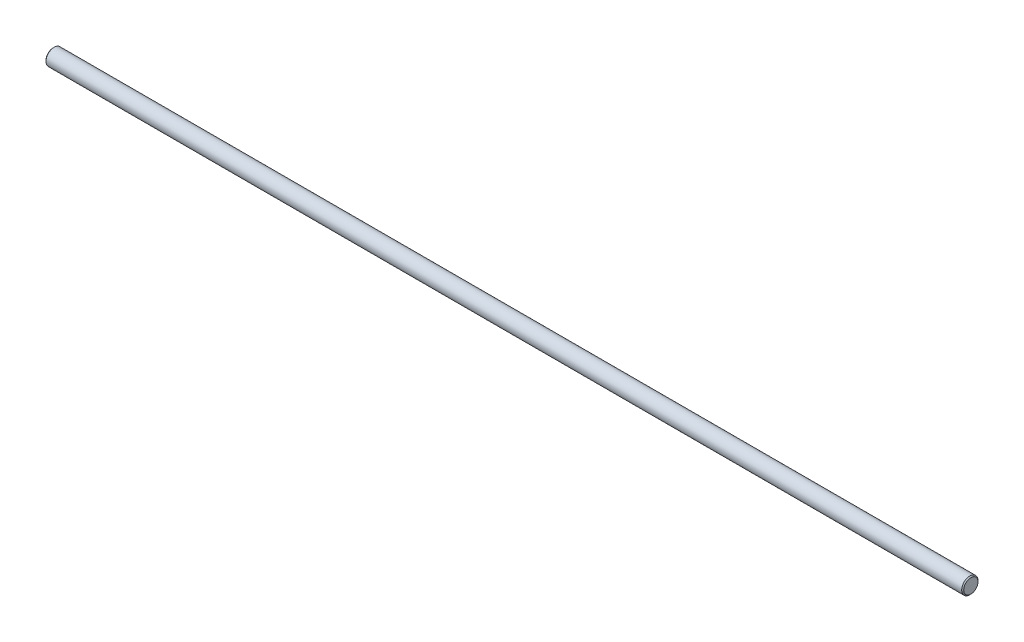
ISO-10303-21;
HEADER;
FILE_DESCRIPTION(('STEP AP214'),'2;1');
FILE_NAME('part.step','',(''),(''),'','','');
FILE_SCHEMA(('AUTOMOTIVE_DESIGN { 1 0 10303 214 1 1 1 1 }'));
ENDSEC;
DATA;
#1=APPLICATION_CONTEXT('core data for automotive mechanical design processes');
#2=APPLICATION_PROTOCOL_DEFINITION('international standard','automotive_design',2000,#1);
#3=PRODUCT_CONTEXT('',#1,'mechanical');
#4=PRODUCT('Part','Part','',(#3));
#5=PRODUCT_RELATED_PRODUCT_CATEGORY('part','',(#4));
#6=PRODUCT_DEFINITION_FORMATION('','',#4);
#7=PRODUCT_DEFINITION_CONTEXT('part definition',#1,'design');
#8=PRODUCT_DEFINITION('design','',#6,#7);
#9=PRODUCT_DEFINITION_SHAPE('','',#8);
#10=(LENGTH_UNIT() NAMED_UNIT(*) SI_UNIT(.MILLI.,.METRE.));
#11=(NAMED_UNIT(*) PLANE_ANGLE_UNIT() SI_UNIT($,.RADIAN.));
#12=(NAMED_UNIT(*) SI_UNIT($,.STERADIAN.) SOLID_ANGLE_UNIT());
#13=UNCERTAINTY_MEASURE_WITH_UNIT(LENGTH_MEASURE(1.E-05),#10,'distance_accuracy_value','');
#14=(GEOMETRIC_REPRESENTATION_CONTEXT(3) GLOBAL_UNCERTAINTY_ASSIGNED_CONTEXT((#13)) GLOBAL_UNIT_ASSIGNED_CONTEXT((#10,
#11,#12)) REPRESENTATION_CONTEXT('',''));
#15=CARTESIAN_POINT('',(0.,0.,0.));
#16=DIRECTION('',(0.,0.,1.));
#17=DIRECTION('',(1.,0.,0.));
#18=AXIS2_PLACEMENT_3D('',#15,#16,#17);
#19=CARTESIAN_POINT('',(450.,0.,0.));
#20=DIRECTION('',(-1.,0.,0.));
#21=DIRECTION('',(0.,0.,1.));
#22=AXIS2_PLACEMENT_3D('',#19,#20,#21);
#23=CYLINDRICAL_SURFACE('',#22,4.);
#24=CARTESIAN_POINT('',(449.5,0.,0.));
#25=DIRECTION('',(1.,0.,0.));
#26=DIRECTION('',(0.,0.,-1.));
#27=AXIS2_PLACEMENT_3D('',#24,#25,#26);
#28=CIRCLE('',#27,4.);
#29=CARTESIAN_POINT('',(449.5,0.,-4.));
#30=VERTEX_POINT('',#29);
#31=EDGE_CURVE('E48',#30,#30,#28,.F.);
#32=ORIENTED_EDGE('',*,*,#31,.T.);
#33=EDGE_LOOP('',(#32));
#34=FACE_BOUND('',#33,.T.);
#35=CARTESIAN_POINT('',(0.5,0.,0.));
#36=DIRECTION('',(1.,0.,0.));
#37=DIRECTION('',(0.,0.,-1.));
#38=AXIS2_PLACEMENT_3D('',#35,#36,#37);
#39=CIRCLE('',#38,4.);
#40=CARTESIAN_POINT('',(0.5,0.,-4.));
#41=VERTEX_POINT('',#40);
#42=EDGE_CURVE('E53',#41,#41,#39,.T.);
#43=ORIENTED_EDGE('',*,*,#42,.T.);
#44=EDGE_LOOP('',(#43));
#45=FACE_BOUND('',#44,.T.);
#46=ADVANCED_FACE('F39',(#34,#45),#23,.T.);
#47=CARTESIAN_POINT('',(450.,0.,0.));
#48=DIRECTION('',(1.,0.,0.));
#49=DIRECTION('',(0.,0.,-1.));
#50=AXIS2_PLACEMENT_3D('',#47,#48,#49);
#51=PLANE('',#50);
#52=CARTESIAN_POINT('',(450.,0.,0.));
#53=DIRECTION('',(1.,0.,0.));
#54=DIRECTION('',(0.,0.,-1.));
#55=AXIS2_PLACEMENT_3D('',#52,#53,#54);
#56=CIRCLE('',#55,3.50000000000006);
#57=CARTESIAN_POINT('',(450.,0.,-3.50000000000006));
#58=VERTEX_POINT('',#57);
#59=EDGE_CURVE('E58',#58,#58,#56,.T.);
#60=ORIENTED_EDGE('',*,*,#59,.T.);
#61=EDGE_LOOP('',(#60));
#62=FACE_BOUND('',#61,.T.);
#63=ADVANCED_FACE('F65',(#62),#51,.T.);
#64=CARTESIAN_POINT('',(0.,0.,0.));
#65=DIRECTION('',(1.,0.,0.));
#66=DIRECTION('',(0.,0.,-1.));
#67=AXIS2_PLACEMENT_3D('',#64,#65,#66);
#68=PLANE('',#67);
#69=CARTESIAN_POINT('',(0.,0.,0.));
#70=DIRECTION('',(1.,0.,0.));
#71=DIRECTION('',(0.,0.,-1.));
#72=AXIS2_PLACEMENT_3D('',#69,#70,#71);
#73=CIRCLE('',#72,3.5);
#74=CARTESIAN_POINT('',(0.,0.,-3.5));
#75=VERTEX_POINT('',#74);
#76=EDGE_CURVE('E10',#75,#75,#73,.F.);
#77=ORIENTED_EDGE('',*,*,#76,.T.);
#78=EDGE_LOOP('',(#77));
#79=FACE_BOUND('',#78,.T.);
#80=ADVANCED_FACE('F69',(#79),#68,.F.);
#81=CARTESIAN_POINT('',(450.,0.,0.));
#82=DIRECTION('',(-1.,0.,0.));
#83=DIRECTION('',(0.,0.,1.));
#84=AXIS2_PLACEMENT_3D('',#81,#82,#83);
#85=CONICAL_SURFACE('',#84,3.50000000000006,0.785398163397445);
#86=ORIENTED_EDGE('',*,*,#31,.F.);
#87=EDGE_LOOP('',(#86));
#88=FACE_BOUND('',#87,.T.);
#89=ORIENTED_EDGE('',*,*,#59,.F.);
#90=EDGE_LOOP('',(#89));
#91=FACE_BOUND('',#90,.T.);
#92=ADVANCED_FACE('F67',(#88,#91),#85,.T.);
#93=CARTESIAN_POINT('',(0.5,0.,0.));
#94=DIRECTION('',(1.,0.,0.));
#95=DIRECTION('',(0.,0.,-1.));
#96=AXIS2_PLACEMENT_3D('',#93,#94,#95);
#97=CONICAL_SURFACE('',#96,4.,0.785398163397445);
#98=ORIENTED_EDGE('',*,*,#76,.F.);
#99=EDGE_LOOP('',(#98));
#100=FACE_BOUND('',#99,.T.);
#101=ORIENTED_EDGE('',*,*,#42,.F.);
#102=EDGE_LOOP('',(#101));
#103=FACE_BOUND('',#102,.T.);
#104=ADVANCED_FACE('F42',(#100,#103),#97,.T.);
#105=CLOSED_SHELL('',(#46,#63,#80,#92,#104));
#106=MANIFOLD_SOLID_BREP('B2',#105);
#107=ADVANCED_BREP_SHAPE_REPRESENTATION('',(#18,#106),#14);
#108=SHAPE_DEFINITION_REPRESENTATION(#9,#107);
ENDSEC;
END-ISO-10303-21;
